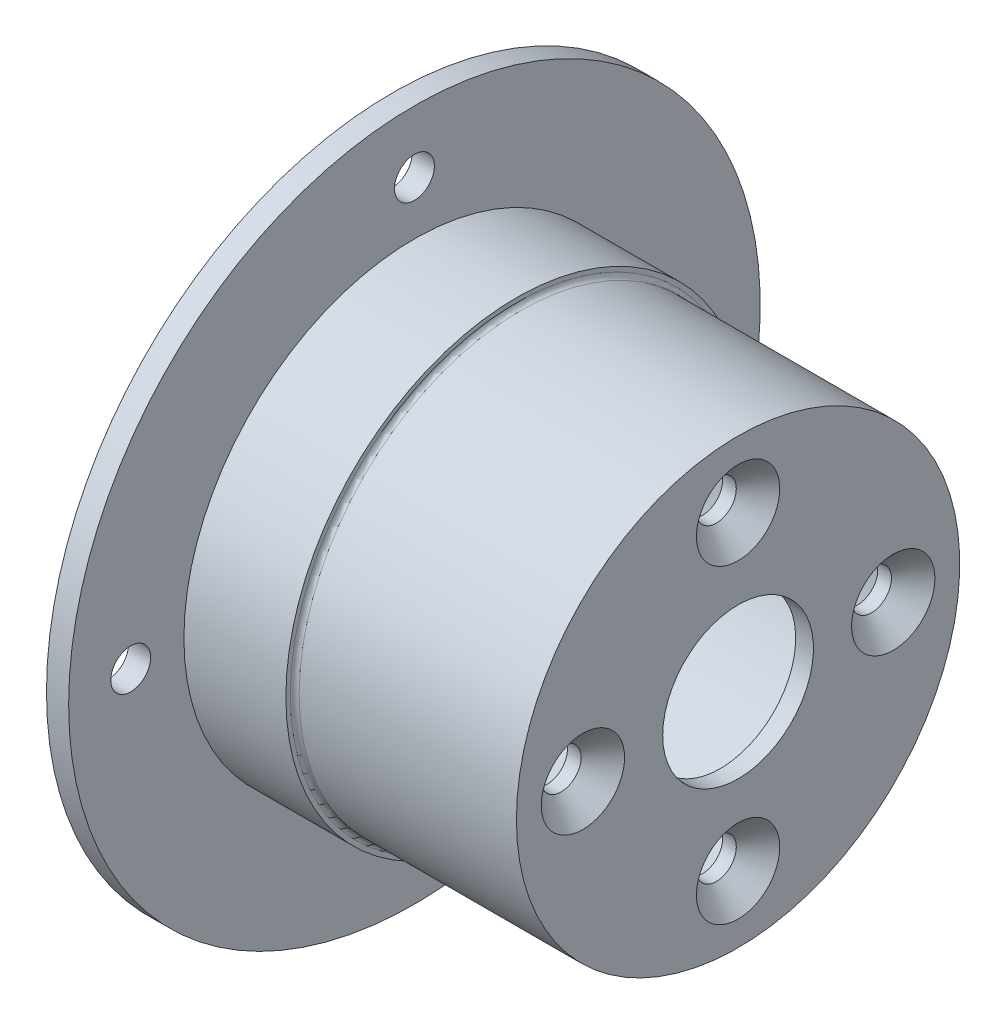
ISO-10303-21;
HEADER;
FILE_DESCRIPTION(('STEP AP214'),'2;1');
FILE_NAME('part.step','',(''),(''),'','','');
FILE_SCHEMA(('AUTOMOTIVE_DESIGN { 1 0 10303 214 1 1 1 1 }'));
ENDSEC;
DATA;
#1=APPLICATION_CONTEXT('core data for automotive mechanical design processes');
#2=APPLICATION_PROTOCOL_DEFINITION('international standard','automotive_design',2000,#1);
#3=PRODUCT_CONTEXT('',#1,'mechanical');
#4=PRODUCT('Part','Part','',(#3));
#5=PRODUCT_RELATED_PRODUCT_CATEGORY('part','',(#4));
#6=PRODUCT_DEFINITION_FORMATION('','',#4);
#7=PRODUCT_DEFINITION_CONTEXT('part definition',#1,'design');
#8=PRODUCT_DEFINITION('design','',#6,#7);
#9=PRODUCT_DEFINITION_SHAPE('','',#8);
#10=(LENGTH_UNIT() NAMED_UNIT(*) SI_UNIT(.MILLI.,.METRE.));
#11=(NAMED_UNIT(*) PLANE_ANGLE_UNIT() SI_UNIT($,.RADIAN.));
#12=(NAMED_UNIT(*) SI_UNIT($,.STERADIAN.) SOLID_ANGLE_UNIT());
#13=UNCERTAINTY_MEASURE_WITH_UNIT(LENGTH_MEASURE(1.E-05),#10,'distance_accuracy_value','');
#14=(GEOMETRIC_REPRESENTATION_CONTEXT(3) GLOBAL_UNCERTAINTY_ASSIGNED_CONTEXT((#13)) GLOBAL_UNIT_ASSIGNED_CONTEXT((#10,
#11,#12)) REPRESENTATION_CONTEXT('',''));
#15=CARTESIAN_POINT('',(0.,0.,0.));
#16=DIRECTION('',(0.,0.,1.));
#17=DIRECTION('',(1.,0.,0.));
#18=AXIS2_PLACEMENT_3D('',#15,#16,#17);
#19=CARTESIAN_POINT('',(0.,39.,0.));
#20=DIRECTION('',(1.,0.,0.));
#21=DIRECTION('',(0.,0.,-1.));
#22=AXIS2_PLACEMENT_3D('',#19,#20,#21);
#23=PLANE('',#22);
#24=CARTESIAN_POINT('',(0.,0.,32.));
#25=DIRECTION('',(-1.,0.,0.));
#26=DIRECTION('',(0.,0.,1.));
#27=AXIS2_PLACEMENT_3D('',#24,#25,#26);
#28=CIRCLE('',#27,2.25);
#29=CARTESIAN_POINT('',(0.,0.,34.25));
#30=VERTEX_POINT('',#29);
#31=EDGE_CURVE('E137',#30,#30,#28,.T.);
#32=ORIENTED_EDGE('',*,*,#31,.F.);
#33=EDGE_LOOP('',(#32));
#34=FACE_BOUND('',#33,.T.);
#35=CARTESIAN_POINT('',(0.,0.,-32.));
#36=DIRECTION('',(-1.,0.,0.));
#37=DIRECTION('',(0.,0.,1.));
#38=AXIS2_PLACEMENT_3D('',#35,#36,#37);
#39=CIRCLE('',#38,2.25);
#40=CARTESIAN_POINT('',(0.,0.,-29.75));
#41=VERTEX_POINT('',#40);
#42=EDGE_CURVE('E131',#41,#41,#39,.T.);
#43=ORIENTED_EDGE('',*,*,#42,.F.);
#44=EDGE_LOOP('',(#43));
#45=FACE_BOUND('',#44,.T.);
#46=CARTESIAN_POINT('',(0.,0.,0.));
#47=DIRECTION('',(-1.,0.,0.));
#48=DIRECTION('',(0.,0.,1.));
#49=AXIS2_PLACEMENT_3D('',#46,#47,#48);
#50=CIRCLE('',#49,21.);
#51=CARTESIAN_POINT('',(0.,0.,21.));
#52=VERTEX_POINT('',#51);
#53=EDGE_CURVE('E49',#52,#52,#50,.T.);
#54=ORIENTED_EDGE('',*,*,#53,.F.);
#55=EDGE_LOOP('',(#54));
#56=FACE_BOUND('',#55,.T.);
#57=CARTESIAN_POINT('',(0.,0.,0.));
#58=DIRECTION('',(-1.,0.,0.));
#59=DIRECTION('',(0.,0.,1.));
#60=AXIS2_PLACEMENT_3D('',#57,#58,#59);
#61=CIRCLE('',#60,39.);
#62=CARTESIAN_POINT('',(0.,0.,39.));
#63=VERTEX_POINT('',#62);
#64=EDGE_CURVE('E86',#63,#63,#61,.T.);
#65=ORIENTED_EDGE('',*,*,#64,.T.);
#66=EDGE_LOOP('',(#65));
#67=FACE_BOUND('',#66,.T.);
#68=CARTESIAN_POINT('',(0.,-32.,0.));
#69=DIRECTION('',(-1.,0.,0.));
#70=DIRECTION('',(0.,0.,1.));
#71=AXIS2_PLACEMENT_3D('',#68,#69,#70);
#72=CIRCLE('',#71,2.25);
#73=CARTESIAN_POINT('',(0.,-32.,2.25));
#74=VERTEX_POINT('',#73);
#75=EDGE_CURVE('E143',#74,#74,#72,.T.);
#76=ORIENTED_EDGE('',*,*,#75,.F.);
#77=EDGE_LOOP('',(#76));
#78=FACE_BOUND('',#77,.T.);
#79=CARTESIAN_POINT('',(0.,32.,0.));
#80=DIRECTION('',(-1.,0.,0.));
#81=DIRECTION('',(0.,0.,1.));
#82=AXIS2_PLACEMENT_3D('',#79,#80,#81);
#83=CIRCLE('',#82,2.25);
#84=CARTESIAN_POINT('',(0.,32.,2.25));
#85=VERTEX_POINT('',#84);
#86=EDGE_CURVE('E149',#85,#85,#83,.T.);
#87=ORIENTED_EDGE('',*,*,#86,.F.);
#88=EDGE_LOOP('',(#87));
#89=FACE_BOUND('',#88,.T.);
#90=ADVANCED_FACE('F35',(#34,#45,#56,#67,#78,#89),#23,.F.);
#91=CARTESIAN_POINT('',(39.,8.5,0.));
#92=DIRECTION('',(-1.,0.,0.));
#93=DIRECTION('',(0.,0.,1.));
#94=AXIS2_PLACEMENT_3D('',#91,#92,#93);
#95=PLANE('',#94);
#96=CARTESIAN_POINT('',(39.,17.5,0.));
#97=DIRECTION('',(1.,0.,0.));
#98=DIRECTION('',(0.,0.,-1.));
#99=AXIS2_PLACEMENT_3D('',#96,#97,#98);
#100=CIRCLE('',#99,4.7);
#101=CARTESIAN_POINT('',(39.,17.5,-4.7));
#102=VERTEX_POINT('',#101);
#103=EDGE_CURVE('E125',#102,#102,#100,.T.);
#104=ORIENTED_EDGE('',*,*,#103,.F.);
#105=EDGE_LOOP('',(#104));
#106=FACE_BOUND('',#105,.T.);
#107=CARTESIAN_POINT('',(39.,0.,17.5));
#108=DIRECTION('',(1.,0.,0.));
#109=DIRECTION('',(0.,0.,-1.));
#110=AXIS2_PLACEMENT_3D('',#107,#108,#109);
#111=CIRCLE('',#110,4.7);
#112=CARTESIAN_POINT('',(39.,0.,12.8));
#113=VERTEX_POINT('',#112);
#114=EDGE_CURVE('E97',#113,#113,#111,.T.);
#115=ORIENTED_EDGE('',*,*,#114,.F.);
#116=EDGE_LOOP('',(#115));
#117=FACE_BOUND('',#116,.T.);
#118=CARTESIAN_POINT('',(39.,0.,0.));
#119=DIRECTION('',(-1.,0.,0.));
#120=DIRECTION('',(0.,0.,1.));
#121=AXIS2_PLACEMENT_3D('',#118,#119,#120);
#122=CIRCLE('',#121,25.);
#123=CARTESIAN_POINT('',(39.,0.,25.));
#124=VERTEX_POINT('',#123);
#125=EDGE_CURVE('E72',#124,#124,#122,.T.);
#126=ORIENTED_EDGE('',*,*,#125,.F.);
#127=EDGE_LOOP('',(#126));
#128=FACE_BOUND('',#127,.T.);
#129=CARTESIAN_POINT('',(39.,0.,0.));
#130=DIRECTION('',(-1.,0.,0.));
#131=DIRECTION('',(0.,0.,1.));
#132=AXIS2_PLACEMENT_3D('',#129,#130,#131);
#133=CIRCLE('',#132,8.5);
#134=CARTESIAN_POINT('',(39.,0.,8.5));
#135=VERTEX_POINT('',#134);
#136=EDGE_CURVE('E69',#135,#135,#133,.T.);
#137=ORIENTED_EDGE('',*,*,#136,.T.);
#138=EDGE_LOOP('',(#137));
#139=FACE_BOUND('',#138,.T.);
#140=CARTESIAN_POINT('',(39.,-17.5,0.));
#141=DIRECTION('',(1.,0.,0.));
#142=DIRECTION('',(0.,0.,-1.));
#143=AXIS2_PLACEMENT_3D('',#140,#141,#142);
#144=CIRCLE('',#143,4.7);
#145=CARTESIAN_POINT('',(39.,-17.5,-4.7));
#146=VERTEX_POINT('',#145);
#147=EDGE_CURVE('E107',#146,#146,#144,.T.);
#148=ORIENTED_EDGE('',*,*,#147,.F.);
#149=EDGE_LOOP('',(#148));
#150=FACE_BOUND('',#149,.T.);
#151=CARTESIAN_POINT('',(39.,0.,-17.5));
#152=DIRECTION('',(1.,0.,0.));
#153=DIRECTION('',(0.,0.,-1.));
#154=AXIS2_PLACEMENT_3D('',#151,#152,#153);
#155=CIRCLE('',#154,4.7);
#156=CARTESIAN_POINT('',(39.,0.,-22.2));
#157=VERTEX_POINT('',#156);
#158=EDGE_CURVE('E116',#157,#157,#155,.T.);
#159=ORIENTED_EDGE('',*,*,#158,.F.);
#160=EDGE_LOOP('',(#159));
#161=FACE_BOUND('',#160,.T.);
#162=ADVANCED_FACE('F156',(#106,#117,#128,#139,#150,#161),#95,.F.);
#163=CARTESIAN_POINT('',(-64.1033524540557,0.,0.));
#164=DIRECTION('',(-1.,0.,0.));
#165=DIRECTION('',(0.,0.,1.));
#166=AXIS2_PLACEMENT_3D('',#163,#164,#165);
#167=CYLINDRICAL_SURFACE('',#166,21.);
#168=CARTESIAN_POINT('',(35.,0.,0.));
#169=DIRECTION('',(-1.,0.,0.));
#170=DIRECTION('',(0.,0.,1.));
#171=AXIS2_PLACEMENT_3D('',#168,#169,#170);
#172=CIRCLE('',#171,21.);
#173=CARTESIAN_POINT('',(35.,0.,21.));
#174=VERTEX_POINT('',#173);
#175=EDGE_CURVE('E54',#174,#174,#172,.T.);
#176=ORIENTED_EDGE('',*,*,#175,.F.);
#177=EDGE_LOOP('',(#176));
#178=FACE_BOUND('',#177,.T.);
#179=ORIENTED_EDGE('',*,*,#53,.T.);
#180=EDGE_LOOP('',(#179));
#181=FACE_BOUND('',#180,.T.);
#182=ADVANCED_FACE('F162',(#178,#181),#167,.F.);
#183=CARTESIAN_POINT('',(35.,21.,0.));
#184=DIRECTION('',(1.,0.,0.));
#185=DIRECTION('',(0.,0.,-1.));
#186=AXIS2_PLACEMENT_3D('',#183,#184,#185);
#187=PLANE('',#186);
#188=CARTESIAN_POINT('',(35.,17.5,0.));
#189=DIRECTION('',(1.,0.,0.));
#190=DIRECTION('',(0.,0.,-1.));
#191=AXIS2_PLACEMENT_3D('',#188,#189,#190);
#192=CIRCLE('',#191,2.24999999999999);
#193=CARTESIAN_POINT('',(35.,17.5,-2.24999999999999));
#194=VERTEX_POINT('',#193);
#195=EDGE_CURVE('E119',#194,#194,#192,.T.);
#196=ORIENTED_EDGE('',*,*,#195,.T.);
#197=EDGE_LOOP('',(#196));
#198=FACE_BOUND('',#197,.T.);
#199=CARTESIAN_POINT('',(35.,0.,-17.5));
#200=DIRECTION('',(1.,0.,0.));
#201=DIRECTION('',(0.,0.,-1.));
#202=AXIS2_PLACEMENT_3D('',#199,#200,#201);
#203=CIRCLE('',#202,2.24999999999999);
#204=CARTESIAN_POINT('',(35.,0.,-19.75));
#205=VERTEX_POINT('',#204);
#206=EDGE_CURVE('E110',#205,#205,#203,.T.);
#207=ORIENTED_EDGE('',*,*,#206,.T.);
#208=EDGE_LOOP('',(#207));
#209=FACE_BOUND('',#208,.T.);
#210=CARTESIAN_POINT('',(35.,-17.5,0.));
#211=DIRECTION('',(1.,0.,0.));
#212=DIRECTION('',(0.,0.,-1.));
#213=AXIS2_PLACEMENT_3D('',#210,#211,#212);
#214=CIRCLE('',#213,2.24999999999999);
#215=CARTESIAN_POINT('',(35.,-17.5,-2.24999999999999));
#216=VERTEX_POINT('',#215);
#217=EDGE_CURVE('E101',#216,#216,#214,.T.);
#218=ORIENTED_EDGE('',*,*,#217,.T.);
#219=EDGE_LOOP('',(#218));
#220=FACE_BOUND('',#219,.T.);
#221=CARTESIAN_POINT('',(35.,0.,17.5));
#222=DIRECTION('',(1.,0.,0.));
#223=DIRECTION('',(0.,0.,-1.));
#224=AXIS2_PLACEMENT_3D('',#221,#222,#223);
#225=CIRCLE('',#224,2.24999999999999);
#226=CARTESIAN_POINT('',(35.,0.,15.25));
#227=VERTEX_POINT('',#226);
#228=EDGE_CURVE('E90',#227,#227,#225,.T.);
#229=ORIENTED_EDGE('',*,*,#228,.T.);
#230=EDGE_LOOP('',(#229));
#231=FACE_BOUND('',#230,.T.);
#232=CARTESIAN_POINT('',(35.,0.,0.));
#233=DIRECTION('',(-1.,0.,0.));
#234=DIRECTION('',(0.,0.,1.));
#235=AXIS2_PLACEMENT_3D('',#232,#233,#234);
#236=CIRCLE('',#235,12.5);
#237=CARTESIAN_POINT('',(35.,0.,12.5));
#238=VERTEX_POINT('',#237);
#239=EDGE_CURVE('E60',#238,#238,#236,.T.);
#240=ORIENTED_EDGE('',*,*,#239,.F.);
#241=EDGE_LOOP('',(#240));
#242=FACE_BOUND('',#241,.T.);
#243=ORIENTED_EDGE('',*,*,#175,.T.);
#244=EDGE_LOOP('',(#243));
#245=FACE_BOUND('',#244,.T.);
#246=ADVANCED_FACE('F200',(#198,#209,#220,#231,#242,#245),#187,.F.);
#247=CARTESIAN_POINT('',(-64.1033524540557,0.,0.));
#248=DIRECTION('',(-1.,0.,0.));
#249=DIRECTION('',(0.,0.,1.));
#250=AXIS2_PLACEMENT_3D('',#247,#248,#249);
#251=CYLINDRICAL_SURFACE('',#250,12.5);
#252=CARTESIAN_POINT('',(37.,0.,0.));
#253=DIRECTION('',(-1.,0.,0.));
#254=DIRECTION('',(0.,0.,1.));
#255=AXIS2_PLACEMENT_3D('',#252,#253,#254);
#256=CIRCLE('',#255,12.5);
#257=CARTESIAN_POINT('',(37.,0.,12.5));
#258=VERTEX_POINT('',#257);
#259=EDGE_CURVE('E63',#258,#258,#256,.T.);
#260=ORIENTED_EDGE('',*,*,#259,.F.);
#261=EDGE_LOOP('',(#260));
#262=FACE_BOUND('',#261,.T.);
#263=ORIENTED_EDGE('',*,*,#239,.T.);
#264=EDGE_LOOP('',(#263));
#265=FACE_BOUND('',#264,.T.);
#266=ADVANCED_FACE('F196',(#262,#265),#251,.F.);
#267=CARTESIAN_POINT('',(37.,12.5,0.));
#268=DIRECTION('',(1.,0.,0.));
#269=DIRECTION('',(0.,0.,-1.));
#270=AXIS2_PLACEMENT_3D('',#267,#268,#269);
#271=PLANE('',#270);
#272=CARTESIAN_POINT('',(37.,0.,0.));
#273=DIRECTION('',(-1.,0.,0.));
#274=DIRECTION('',(0.,0.,1.));
#275=AXIS2_PLACEMENT_3D('',#272,#273,#274);
#276=CIRCLE('',#275,8.5);
#277=CARTESIAN_POINT('',(37.,0.,8.5));
#278=VERTEX_POINT('',#277);
#279=EDGE_CURVE('E66',#278,#278,#276,.T.);
#280=ORIENTED_EDGE('',*,*,#279,.F.);
#281=EDGE_LOOP('',(#280));
#282=FACE_BOUND('',#281,.T.);
#283=ORIENTED_EDGE('',*,*,#259,.T.);
#284=EDGE_LOOP('',(#283));
#285=FACE_BOUND('',#284,.T.);
#286=ADVANCED_FACE('F192',(#282,#285),#271,.F.);
#287=CARTESIAN_POINT('',(-64.1033524540557,0.,0.));
#288=DIRECTION('',(-1.,0.,0.));
#289=DIRECTION('',(0.,0.,1.));
#290=AXIS2_PLACEMENT_3D('',#287,#288,#289);
#291=CYLINDRICAL_SURFACE('',#290,8.5);
#292=ORIENTED_EDGE('',*,*,#136,.F.);
#293=EDGE_LOOP('',(#292));
#294=FACE_BOUND('',#293,.T.);
#295=ORIENTED_EDGE('',*,*,#279,.T.);
#296=EDGE_LOOP('',(#295));
#297=FACE_BOUND('',#296,.T.);
#298=ADVANCED_FACE('F188',(#294,#297),#291,.F.);
#299=CARTESIAN_POINT('',(-64.1033524540557,0.,0.));
#300=DIRECTION('',(-1.,0.,0.));
#301=DIRECTION('',(0.,0.,1.));
#302=AXIS2_PLACEMENT_3D('',#299,#300,#301);
#303=CYLINDRICAL_SURFACE('',#302,25.);
#304=CARTESIAN_POINT('',(14.5,0.,0.));
#305=DIRECTION('',(-1.,0.,0.));
#306=DIRECTION('',(0.,0.,1.));
#307=AXIS2_PLACEMENT_3D('',#304,#305,#306);
#308=CIRCLE('',#307,25.);
#309=CARTESIAN_POINT('',(14.5,0.,25.));
#310=VERTEX_POINT('',#309);
#311=EDGE_CURVE('E10',#310,#310,#308,.F.);
#312=ORIENTED_EDGE('',*,*,#311,.T.);
#313=EDGE_LOOP('',(#312));
#314=FACE_BOUND('',#313,.T.);
#315=ORIENTED_EDGE('',*,*,#125,.T.);
#316=EDGE_LOOP('',(#315));
#317=FACE_BOUND('',#316,.T.);
#318=ADVANCED_FACE('F186',(#314,#317),#303,.T.);
#319=CARTESIAN_POINT('',(14.,25.,0.));
#320=DIRECTION('',(-1.,0.,0.));
#321=DIRECTION('',(0.,0.,1.));
#322=AXIS2_PLACEMENT_3D('',#319,#320,#321);
#323=PLANE('',#322);
#324=CARTESIAN_POINT('',(14.,0.,0.));
#325=DIRECTION('',(-1.,0.,0.));
#326=DIRECTION('',(0.,0.,1.));
#327=AXIS2_PLACEMENT_3D('',#324,#325,#326);
#328=CIRCLE('',#327,25.5);
#329=CARTESIAN_POINT('',(14.,0.,25.5));
#330=VERTEX_POINT('',#329);
#331=EDGE_CURVE('E43',#330,#330,#328,.T.);
#332=ORIENTED_EDGE('',*,*,#331,.T.);
#333=EDGE_LOOP('',(#332));
#334=FACE_BOUND('',#333,.T.);
#335=CARTESIAN_POINT('',(14.,0.,0.));
#336=DIRECTION('',(-1.,0.,0.));
#337=DIRECTION('',(0.,0.,1.));
#338=AXIS2_PLACEMENT_3D('',#335,#336,#337);
#339=CIRCLE('',#338,26.);
#340=CARTESIAN_POINT('',(14.,0.,26.));
#341=VERTEX_POINT('',#340);
#342=EDGE_CURVE('E76',#341,#341,#339,.T.);
#343=ORIENTED_EDGE('',*,*,#342,.F.);
#344=EDGE_LOOP('',(#343));
#345=FACE_BOUND('',#344,.T.);
#346=ADVANCED_FACE('F182',(#334,#345),#323,.F.);
#347=CARTESIAN_POINT('',(-64.1033524540557,0.,0.));
#348=DIRECTION('',(-1.,0.,0.));
#349=DIRECTION('',(0.,0.,1.));
#350=AXIS2_PLACEMENT_3D('',#347,#348,#349);
#351=CYLINDRICAL_SURFACE('',#350,26.);
#352=CARTESIAN_POINT('',(2.5,0.,0.));
#353=DIRECTION('',(-1.,0.,0.));
#354=DIRECTION('',(0.,0.,1.));
#355=AXIS2_PLACEMENT_3D('',#352,#353,#354);
#356=CIRCLE('',#355,26.);
#357=CARTESIAN_POINT('',(2.5,0.,26.));
#358=VERTEX_POINT('',#357);
#359=EDGE_CURVE('E79',#358,#358,#356,.T.);
#360=ORIENTED_EDGE('',*,*,#359,.F.);
#361=EDGE_LOOP('',(#360));
#362=FACE_BOUND('',#361,.T.);
#363=ORIENTED_EDGE('',*,*,#342,.T.);
#364=EDGE_LOOP('',(#363));
#365=FACE_BOUND('',#364,.T.);
#366=ADVANCED_FACE('F178',(#362,#365),#351,.T.);
#367=CARTESIAN_POINT('',(2.5,26.,0.));
#368=DIRECTION('',(-1.,0.,0.));
#369=DIRECTION('',(0.,0.,1.));
#370=AXIS2_PLACEMENT_3D('',#367,#368,#369);
#371=PLANE('',#370);
#372=CARTESIAN_POINT('',(2.5,32.,0.));
#373=DIRECTION('',(-1.,0.,0.));
#374=DIRECTION('',(0.,0.,1.));
#375=AXIS2_PLACEMENT_3D('',#372,#373,#374);
#376=CIRCLE('',#375,2.25);
#377=CARTESIAN_POINT('',(2.5,32.,2.25));
#378=VERTEX_POINT('',#377);
#379=EDGE_CURVE('E146',#378,#378,#376,.T.);
#380=ORIENTED_EDGE('',*,*,#379,.T.);
#381=EDGE_LOOP('',(#380));
#382=FACE_BOUND('',#381,.T.);
#383=CARTESIAN_POINT('',(2.5,-32.,0.));
#384=DIRECTION('',(-1.,0.,0.));
#385=DIRECTION('',(0.,0.,1.));
#386=AXIS2_PLACEMENT_3D('',#383,#384,#385);
#387=CIRCLE('',#386,2.25);
#388=CARTESIAN_POINT('',(2.5,-32.,2.25));
#389=VERTEX_POINT('',#388);
#390=EDGE_CURVE('E140',#389,#389,#387,.T.);
#391=ORIENTED_EDGE('',*,*,#390,.T.);
#392=EDGE_LOOP('',(#391));
#393=FACE_BOUND('',#392,.T.);
#394=CARTESIAN_POINT('',(2.5,0.,32.));
#395=DIRECTION('',(-1.,0.,0.));
#396=DIRECTION('',(0.,0.,1.));
#397=AXIS2_PLACEMENT_3D('',#394,#395,#396);
#398=CIRCLE('',#397,2.25);
#399=CARTESIAN_POINT('',(2.5,0.,34.25));
#400=VERTEX_POINT('',#399);
#401=EDGE_CURVE('E134',#400,#400,#398,.T.);
#402=ORIENTED_EDGE('',*,*,#401,.T.);
#403=EDGE_LOOP('',(#402));
#404=FACE_BOUND('',#403,.T.);
#405=CARTESIAN_POINT('',(2.5,0.,-32.));
#406=DIRECTION('',(-1.,0.,0.));
#407=DIRECTION('',(0.,0.,1.));
#408=AXIS2_PLACEMENT_3D('',#405,#406,#407);
#409=CIRCLE('',#408,2.25);
#410=CARTESIAN_POINT('',(2.5,0.,-29.75));
#411=VERTEX_POINT('',#410);
#412=EDGE_CURVE('E128',#411,#411,#409,.T.);
#413=ORIENTED_EDGE('',*,*,#412,.T.);
#414=EDGE_LOOP('',(#413));
#415=FACE_BOUND('',#414,.T.);
#416=CARTESIAN_POINT('',(2.5,0.,0.));
#417=DIRECTION('',(-1.,0.,0.));
#418=DIRECTION('',(0.,0.,1.));
#419=AXIS2_PLACEMENT_3D('',#416,#417,#418);
#420=CIRCLE('',#419,39.);
#421=CARTESIAN_POINT('',(2.5,0.,39.));
#422=VERTEX_POINT('',#421);
#423=EDGE_CURVE('E82',#422,#422,#420,.T.);
#424=ORIENTED_EDGE('',*,*,#423,.F.);
#425=EDGE_LOOP('',(#424));
#426=FACE_BOUND('',#425,.T.);
#427=ORIENTED_EDGE('',*,*,#359,.T.);
#428=EDGE_LOOP('',(#427));
#429=FACE_BOUND('',#428,.T.);
#430=ADVANCED_FACE('F174',(#382,#393,#404,#415,#426,#429),#371,.F.);
#431=CARTESIAN_POINT('',(-64.1033524540557,0.,0.));
#432=DIRECTION('',(-1.,0.,0.));
#433=DIRECTION('',(0.,0.,1.));
#434=AXIS2_PLACEMENT_3D('',#431,#432,#433);
#435=CYLINDRICAL_SURFACE('',#434,39.);
#436=ORIENTED_EDGE('',*,*,#64,.F.);
#437=EDGE_LOOP('',(#436));
#438=FACE_BOUND('',#437,.T.);
#439=ORIENTED_EDGE('',*,*,#423,.T.);
#440=EDGE_LOOP('',(#439));
#441=FACE_BOUND('',#440,.T.);
#442=ADVANCED_FACE('F171',(#438,#441),#435,.T.);
#443=CARTESIAN_POINT('',(39.,0.,17.5));
#444=DIRECTION('',(1.,0.,0.));
#445=DIRECTION('',(0.,0.,-1.));
#446=AXIS2_PLACEMENT_3D('',#443,#444,#445);
#447=CYLINDRICAL_SURFACE('',#446,2.24999999999999);
#448=ORIENTED_EDGE('',*,*,#228,.F.);
#449=EDGE_LOOP('',(#448));
#450=FACE_BOUND('',#449,.T.);
#451=CARTESIAN_POINT('',(36.55,0.,17.5));
#452=DIRECTION('',(1.,0.,0.));
#453=DIRECTION('',(0.,0.,-1.));
#454=AXIS2_PLACEMENT_3D('',#451,#452,#453);
#455=CIRCLE('',#454,2.24999999999999);
#456=CARTESIAN_POINT('',(36.55,0.,15.25));
#457=VERTEX_POINT('',#456);
#458=EDGE_CURVE('E93',#457,#457,#455,.T.);
#459=ORIENTED_EDGE('',*,*,#458,.T.);
#460=EDGE_LOOP('',(#459));
#461=FACE_BOUND('',#460,.T.);
#462=ADVANCED_FACE('F169',(#450,#461),#447,.F.);
#463=CARTESIAN_POINT('',(39.,0.,17.5));
#464=DIRECTION('',(1.,0.,0.));
#465=DIRECTION('',(0.,0.,-1.));
#466=AXIS2_PLACEMENT_3D('',#463,#464,#465);
#467=CONICAL_SURFACE('',#466,4.7,0.785398163397449);
#468=ORIENTED_EDGE('',*,*,#458,.F.);
#469=EDGE_LOOP('',(#468));
#470=FACE_BOUND('',#469,.T.);
#471=ORIENTED_EDGE('',*,*,#114,.T.);
#472=EDGE_LOOP('',(#471));
#473=FACE_BOUND('',#472,.T.);
#474=ADVANCED_FACE('F258',(#470,#473),#467,.F.);
#475=CARTESIAN_POINT('',(39.,-17.5,0.));
#476=DIRECTION('',(1.,0.,0.));
#477=DIRECTION('',(0.,0.,-1.));
#478=AXIS2_PLACEMENT_3D('',#475,#476,#477);
#479=CYLINDRICAL_SURFACE('',#478,2.24999999999999);
#480=ORIENTED_EDGE('',*,*,#217,.F.);
#481=EDGE_LOOP('',(#480));
#482=FACE_BOUND('',#481,.T.);
#483=CARTESIAN_POINT('',(36.55,-17.5,0.));
#484=DIRECTION('',(1.,0.,0.));
#485=DIRECTION('',(0.,0.,-1.));
#486=AXIS2_PLACEMENT_3D('',#483,#484,#485);
#487=CIRCLE('',#486,2.24999999999999);
#488=CARTESIAN_POINT('',(36.55,-17.5,-2.24999999999999));
#489=VERTEX_POINT('',#488);
#490=EDGE_CURVE('E104',#489,#489,#487,.T.);
#491=ORIENTED_EDGE('',*,*,#490,.T.);
#492=EDGE_LOOP('',(#491));
#493=FACE_BOUND('',#492,.T.);
#494=ADVANCED_FACE('F255',(#482,#493),#479,.F.);
#495=CARTESIAN_POINT('',(39.,-17.5,0.));
#496=DIRECTION('',(1.,0.,0.));
#497=DIRECTION('',(0.,0.,-1.));
#498=AXIS2_PLACEMENT_3D('',#495,#496,#497);
#499=CONICAL_SURFACE('',#498,4.7,0.785398163397449);
#500=ORIENTED_EDGE('',*,*,#490,.F.);
#501=EDGE_LOOP('',(#500));
#502=FACE_BOUND('',#501,.T.);
#503=ORIENTED_EDGE('',*,*,#147,.T.);
#504=EDGE_LOOP('',(#503));
#505=FACE_BOUND('',#504,.T.);
#506=ADVANCED_FACE('F251',(#502,#505),#499,.F.);
#507=CARTESIAN_POINT('',(39.,0.,-17.5));
#508=DIRECTION('',(1.,0.,0.));
#509=DIRECTION('',(0.,0.,-1.));
#510=AXIS2_PLACEMENT_3D('',#507,#508,#509);
#511=CYLINDRICAL_SURFACE('',#510,2.24999999999999);
#512=ORIENTED_EDGE('',*,*,#206,.F.);
#513=EDGE_LOOP('',(#512));
#514=FACE_BOUND('',#513,.T.);
#515=CARTESIAN_POINT('',(36.55,0.,-17.5));
#516=DIRECTION('',(1.,0.,0.));
#517=DIRECTION('',(0.,0.,-1.));
#518=AXIS2_PLACEMENT_3D('',#515,#516,#517);
#519=CIRCLE('',#518,2.24999999999999);
#520=CARTESIAN_POINT('',(36.55,0.,-19.75));
#521=VERTEX_POINT('',#520);
#522=EDGE_CURVE('E113',#521,#521,#519,.T.);
#523=ORIENTED_EDGE('',*,*,#522,.T.);
#524=EDGE_LOOP('',(#523));
#525=FACE_BOUND('',#524,.T.);
#526=ADVANCED_FACE('F247',(#514,#525),#511,.F.);
#527=CARTESIAN_POINT('',(39.,0.,-17.5));
#528=DIRECTION('',(1.,0.,0.));
#529=DIRECTION('',(0.,0.,-1.));
#530=AXIS2_PLACEMENT_3D('',#527,#528,#529);
#531=CONICAL_SURFACE('',#530,4.7,0.785398163397449);
#532=ORIENTED_EDGE('',*,*,#522,.F.);
#533=EDGE_LOOP('',(#532));
#534=FACE_BOUND('',#533,.T.);
#535=ORIENTED_EDGE('',*,*,#158,.T.);
#536=EDGE_LOOP('',(#535));
#537=FACE_BOUND('',#536,.T.);
#538=ADVANCED_FACE('F243',(#534,#537),#531,.F.);
#539=CARTESIAN_POINT('',(39.,17.5,0.));
#540=DIRECTION('',(1.,0.,0.));
#541=DIRECTION('',(0.,0.,-1.));
#542=AXIS2_PLACEMENT_3D('',#539,#540,#541);
#543=CYLINDRICAL_SURFACE('',#542,2.24999999999999);
#544=ORIENTED_EDGE('',*,*,#195,.F.);
#545=EDGE_LOOP('',(#544));
#546=FACE_BOUND('',#545,.T.);
#547=CARTESIAN_POINT('',(36.55,17.5,0.));
#548=DIRECTION('',(1.,0.,0.));
#549=DIRECTION('',(0.,0.,-1.));
#550=AXIS2_PLACEMENT_3D('',#547,#548,#549);
#551=CIRCLE('',#550,2.24999999999999);
#552=CARTESIAN_POINT('',(36.55,17.5,-2.24999999999999));
#553=VERTEX_POINT('',#552);
#554=EDGE_CURVE('E122',#553,#553,#551,.T.);
#555=ORIENTED_EDGE('',*,*,#554,.T.);
#556=EDGE_LOOP('',(#555));
#557=FACE_BOUND('',#556,.T.);
#558=ADVANCED_FACE('F239',(#546,#557),#543,.F.);
#559=CARTESIAN_POINT('',(39.,17.5,0.));
#560=DIRECTION('',(1.,0.,0.));
#561=DIRECTION('',(0.,0.,-1.));
#562=AXIS2_PLACEMENT_3D('',#559,#560,#561);
#563=CONICAL_SURFACE('',#562,4.7,0.785398163397449);
#564=ORIENTED_EDGE('',*,*,#554,.F.);
#565=EDGE_LOOP('',(#564));
#566=FACE_BOUND('',#565,.T.);
#567=ORIENTED_EDGE('',*,*,#103,.T.);
#568=EDGE_LOOP('',(#567));
#569=FACE_BOUND('',#568,.T.);
#570=ADVANCED_FACE('F235',(#566,#569),#563,.F.);
#571=CARTESIAN_POINT('',(0.,0.,-32.));
#572=DIRECTION('',(-1.,0.,0.));
#573=DIRECTION('',(0.,0.,1.));
#574=AXIS2_PLACEMENT_3D('',#571,#572,#573);
#575=CYLINDRICAL_SURFACE('',#574,2.25);
#576=ORIENTED_EDGE('',*,*,#412,.F.);
#577=EDGE_LOOP('',(#576));
#578=FACE_BOUND('',#577,.T.);
#579=ORIENTED_EDGE('',*,*,#42,.T.);
#580=EDGE_LOOP('',(#579));
#581=FACE_BOUND('',#580,.T.);
#582=ADVANCED_FACE('F228',(#578,#581),#575,.F.);
#583=CARTESIAN_POINT('',(0.,0.,32.));
#584=DIRECTION('',(-1.,0.,0.));
#585=DIRECTION('',(0.,0.,1.));
#586=AXIS2_PLACEMENT_3D('',#583,#584,#585);
#587=CYLINDRICAL_SURFACE('',#586,2.25);
#588=ORIENTED_EDGE('',*,*,#401,.F.);
#589=EDGE_LOOP('',(#588));
#590=FACE_BOUND('',#589,.T.);
#591=ORIENTED_EDGE('',*,*,#31,.T.);
#592=EDGE_LOOP('',(#591));
#593=FACE_BOUND('',#592,.T.);
#594=ADVANCED_FACE('F219',(#590,#593),#587,.F.);
#595=CARTESIAN_POINT('',(0.,-32.,0.));
#596=DIRECTION('',(-1.,0.,0.));
#597=DIRECTION('',(0.,0.,1.));
#598=AXIS2_PLACEMENT_3D('',#595,#596,#597);
#599=CYLINDRICAL_SURFACE('',#598,2.25);
#600=ORIENTED_EDGE('',*,*,#390,.F.);
#601=EDGE_LOOP('',(#600));
#602=FACE_BOUND('',#601,.T.);
#603=ORIENTED_EDGE('',*,*,#75,.T.);
#604=EDGE_LOOP('',(#603));
#605=FACE_BOUND('',#604,.T.);
#606=ADVANCED_FACE('F217',(#602,#605),#599,.F.);
#607=CARTESIAN_POINT('',(0.,32.,0.));
#608=DIRECTION('',(-1.,0.,0.));
#609=DIRECTION('',(0.,0.,1.));
#610=AXIS2_PLACEMENT_3D('',#607,#608,#609);
#611=CYLINDRICAL_SURFACE('',#610,2.25);
#612=ORIENTED_EDGE('',*,*,#379,.F.);
#613=EDGE_LOOP('',(#612));
#614=FACE_BOUND('',#613,.T.);
#615=ORIENTED_EDGE('',*,*,#86,.T.);
#616=EDGE_LOOP('',(#615));
#617=FACE_BOUND('',#616,.T.);
#618=ADVANCED_FACE('F153',(#614,#617),#611,.F.);
#619=CARTESIAN_POINT('',(14.5,0.,0.));
#620=DIRECTION('',(-1.,0.,0.));
#621=DIRECTION('',(0.,0.,1.));
#622=AXIS2_PLACEMENT_3D('',#619,#620,#621);
#623=TOROIDAL_SURFACE('',#622,25.5,0.5);
#624=ORIENTED_EDGE('',*,*,#311,.F.);
#625=EDGE_LOOP('',(#624));
#626=FACE_BOUND('',#625,.T.);
#627=ORIENTED_EDGE('',*,*,#331,.F.);
#628=EDGE_LOOP('',(#627));
#629=FACE_BOUND('',#628,.T.);
#630=ADVANCED_FACE('F37',(#626,#629),#623,.F.);
#631=CLOSED_SHELL('',(#90,#162,#182,#246,#266,#286,#298,#318,#346,#366,#430,#442,#462,#474,#494,
#506,#526,#538,#558,#570,#582,#594,#606,#618,#630));
#632=MANIFOLD_SOLID_BREP('B2',#631);
#633=ADVANCED_BREP_SHAPE_REPRESENTATION('',(#18,#632),#14);
#634=SHAPE_DEFINITION_REPRESENTATION(#9,#633);
ENDSEC;
END-ISO-10303-21;
